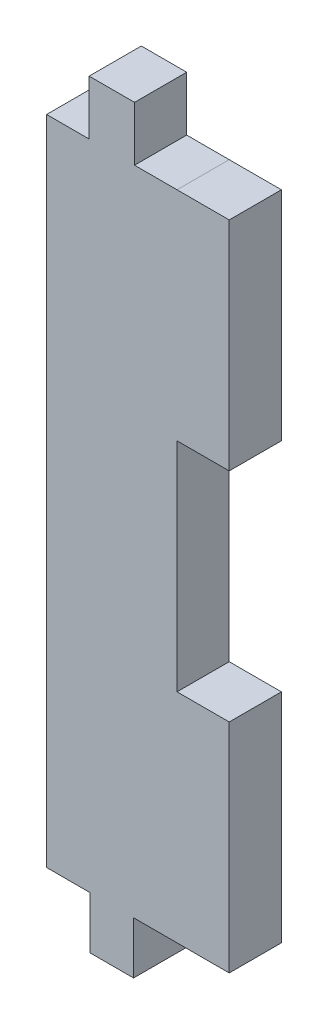
ISO-10303-21;
HEADER;
FILE_DESCRIPTION(('STEP AP214'),'2;1');
FILE_NAME('part.step','',(''),(''),'','','');
FILE_SCHEMA(('AUTOMOTIVE_DESIGN { 1 0 10303 214 1 1 1 1 }'));
ENDSEC;
DATA;
#1=APPLICATION_CONTEXT('core data for automotive mechanical design processes');
#2=APPLICATION_PROTOCOL_DEFINITION('international standard','automotive_design',2000,#1);
#3=PRODUCT_CONTEXT('',#1,'mechanical');
#4=PRODUCT('Part','Part','',(#3));
#5=PRODUCT_RELATED_PRODUCT_CATEGORY('part','',(#4));
#6=PRODUCT_DEFINITION_FORMATION('','',#4);
#7=PRODUCT_DEFINITION_CONTEXT('part definition',#1,'design');
#8=PRODUCT_DEFINITION('design','',#6,#7);
#9=PRODUCT_DEFINITION_SHAPE('','',#8);
#10=(LENGTH_UNIT() NAMED_UNIT(*) SI_UNIT(.MILLI.,.METRE.));
#11=(NAMED_UNIT(*) PLANE_ANGLE_UNIT() SI_UNIT($,.RADIAN.));
#12=(NAMED_UNIT(*) SI_UNIT($,.STERADIAN.) SOLID_ANGLE_UNIT());
#13=UNCERTAINTY_MEASURE_WITH_UNIT(LENGTH_MEASURE(1.E-05),#10,'distance_accuracy_value','');
#14=(GEOMETRIC_REPRESENTATION_CONTEXT(3) GLOBAL_UNCERTAINTY_ASSIGNED_CONTEXT((#13)) GLOBAL_UNIT_ASSIGNED_CONTEXT((#10,
#11,#12)) REPRESENTATION_CONTEXT('',''));
#15=CARTESIAN_POINT('',(0.,0.,0.));
#16=DIRECTION('',(0.,0.,1.));
#17=DIRECTION('',(1.,0.,0.));
#18=AXIS2_PLACEMENT_3D('',#15,#16,#17);
#19=CARTESIAN_POINT('',(-23.2300312184797,-66.1800034107966,4.));
#20=DIRECTION('',(-1.,0.,0.));
#21=DIRECTION('',(0.,0.,1.));
#22=AXIS2_PLACEMENT_3D('',#19,#20,#21);
#23=PLANE('',#22);
#24=DIRECTION('',(0.,0.,1.));
#25=VECTOR('',#24,1.);
#26=CARTESIAN_POINT('',(-23.2300312184797,-49.5136692647141,0.));
#27=LINE('',#26,#25);
#28=CARTESIAN_POINT('',(-23.2300312184797,-49.5136692647141,0.));
#29=VERTEX_POINT('',#28);
#30=CARTESIAN_POINT('',(-23.2300312184797,-49.5136692647141,4.));
#31=VERTEX_POINT('',#30);
#32=EDGE_CURVE('E423',#29,#31,#27,.T.);
#33=ORIENTED_EDGE('',*,*,#32,.T.);
#34=DIRECTION('',(0.,1.,0.));
#35=VECTOR('',#34,1.);
#36=CARTESIAN_POINT('',(-23.2300312184797,-66.1800034107966,4.));
#37=LINE('',#36,#35);
#38=CARTESIAN_POINT('',(-23.2300312184797,-66.1800034107966,4.));
#39=VERTEX_POINT('',#38);
#40=EDGE_CURVE('E329',#39,#31,#37,.T.);
#41=ORIENTED_EDGE('',*,*,#40,.F.);
#42=DIRECTION('',(0.,0.,-1.));
#43=VECTOR('',#42,1.);
#44=CARTESIAN_POINT('',(-23.2300312184797,-66.1800034107966,4.));
#45=LINE('',#44,#43);
#46=CARTESIAN_POINT('',(-23.2300312184797,-66.1800034107966,0.));
#47=VERTEX_POINT('',#46);
#48=EDGE_CURVE('E240',#39,#47,#45,.T.);
#49=ORIENTED_EDGE('',*,*,#48,.T.);
#50=DIRECTION('',(0.,1.,0.));
#51=VECTOR('',#50,1.);
#52=CARTESIAN_POINT('',(-23.2300312184797,-66.1800034107966,0.));
#53=LINE('',#52,#51);
#54=EDGE_CURVE('E336',#47,#29,#53,.T.);
#55=ORIENTED_EDGE('',*,*,#54,.T.);
#56=EDGE_LOOP('',(#33,#41,#49,#55));
#57=FACE_BOUND('',#56,.T.);
#58=ADVANCED_FACE('F105',(#57),#23,.F.);
#59=CARTESIAN_POINT('',(-37.2300312184796,-66.1800034107966,0.));
#60=DIRECTION('',(0.,0.,1.));
#61=DIRECTION('',(1.,0.,0.));
#62=AXIS2_PLACEMENT_3D('',#59,#60,#61);
#63=PLANE('',#62);
#64=DIRECTION('',(1.,0.,0.));
#65=VECTOR('',#64,1.);
#66=CARTESIAN_POINT('',(-37.2300312184797,-16.1800034107966,0.));
#67=LINE('',#66,#65);
#68=CARTESIAN_POINT('',(-30.4901950371512,-16.1800034107966,0.));
#69=VERTEX_POINT('',#68);
#70=CARTESIAN_POINT('',(-27.2300312184797,-16.1801696710887,0.));
#71=VERTEX_POINT('',#70);
#72=EDGE_CURVE('E257',#69,#71,#67,.T.);
#73=ORIENTED_EDGE('',*,*,#72,.T.);
#74=DIRECTION('',(1.,0.,0.));
#75=VECTOR('',#74,1.);
#76=CARTESIAN_POINT('',(-27.2300312184797,-16.1803359313808,0.));
#77=LINE('',#76,#75);
#78=CARTESIAN_POINT('',(-23.2300312184797,-16.1803359313808,0.));
#79=VERTEX_POINT('',#78);
#80=EDGE_CURVE('E332',#71,#79,#77,.T.);
#81=ORIENTED_EDGE('',*,*,#80,.T.);
#82=CARTESIAN_POINT('',(-23.2300312184797,-32.8470025980475,0.));
#83=VERTEX_POINT('',#82);
#84=EDGE_CURVE('E109',#83,#79,#53,.T.);
#85=ORIENTED_EDGE('',*,*,#84,.F.);
#86=DIRECTION('',(1.,0.,0.));
#87=VECTOR('',#86,1.);
#88=CARTESIAN_POINT('',(-27.2300312184797,-32.8470025980475,0.));
#89=LINE('',#88,#87);
#90=CARTESIAN_POINT('',(-27.2300312184797,-32.8470025980475,0.));
#91=VERTEX_POINT('',#90);
#92=EDGE_CURVE('E417',#91,#83,#89,.T.);
#93=ORIENTED_EDGE('',*,*,#92,.F.);
#94=DIRECTION('',(0.,-1.,0.));
#95=VECTOR('',#94,1.);
#96=CARTESIAN_POINT('',(-27.2300312184797,-66.1800034107966,0.));
#97=LINE('',#96,#95);
#98=CARTESIAN_POINT('',(-27.2300312184797,-49.5136692647141,0.));
#99=VERTEX_POINT('',#98);
#100=EDGE_CURVE('E411',#91,#99,#97,.T.);
#101=ORIENTED_EDGE('',*,*,#100,.T.);
#102=DIRECTION('',(1.,0.,0.));
#103=VECTOR('',#102,1.);
#104=CARTESIAN_POINT('',(-27.2300312184797,-49.5136692647141,0.));
#105=LINE('',#104,#103);
#106=EDGE_CURVE('E413',#99,#29,#105,.T.);
#107=ORIENTED_EDGE('',*,*,#106,.T.);
#108=ORIENTED_EDGE('',*,*,#54,.F.);
#109=DIRECTION('',(1.,0.,0.));
#110=VECTOR('',#109,1.);
#111=CARTESIAN_POINT('',(-37.2300312184796,-66.1800034107966,0.));
#112=LINE('',#111,#110);
#113=CARTESIAN_POINT('',(-30.563364551813,-66.1800034107966,0.));
#114=VERTEX_POINT('',#113);
#115=EDGE_CURVE('E254',#114,#47,#112,.T.);
#116=ORIENTED_EDGE('',*,*,#115,.F.);
#117=DIRECTION('',(0.,-1.,0.));
#118=VECTOR('',#117,1.);
#119=CARTESIAN_POINT('',(-30.563364551813,-62.1800034107967,0.));
#120=LINE('',#119,#118);
#121=CARTESIAN_POINT('',(-30.563364551813,-70.1800034107967,0.));
#122=VERTEX_POINT('',#121);
#123=EDGE_CURVE('E220',#114,#122,#120,.T.);
#124=ORIENTED_EDGE('',*,*,#123,.T.);
#125=DIRECTION('',(1.,0.,0.));
#126=VECTOR('',#125,1.);
#127=CARTESIAN_POINT('',(-33.8966978851463,-70.1800034107967,0.));
#128=LINE('',#127,#126);
#129=CARTESIAN_POINT('',(-33.8966978851463,-70.1800034107967,0.));
#130=VERTEX_POINT('',#129);
#131=EDGE_CURVE('E348',#130,#122,#128,.T.);
#132=ORIENTED_EDGE('',*,*,#131,.F.);
#133=DIRECTION('',(0.,-1.,0.));
#134=VECTOR('',#133,1.);
#135=CARTESIAN_POINT('',(-33.8966978851463,-62.1800034107967,0.));
#136=LINE('',#135,#134);
#137=CARTESIAN_POINT('',(-33.8966978851463,-66.1800034107966,0.));
#138=VERTEX_POINT('',#137);
#139=EDGE_CURVE('E235',#138,#130,#136,.T.);
#140=ORIENTED_EDGE('',*,*,#139,.F.);
#141=CARTESIAN_POINT('',(-37.2300312184796,-66.1800034107966,0.));
#142=VERTEX_POINT('',#141);
#143=EDGE_CURVE('E195',#142,#138,#112,.T.);
#144=ORIENTED_EDGE('',*,*,#143,.F.);
#145=DIRECTION('',(0.,-1.,0.));
#146=VECTOR('',#145,1.);
#147=CARTESIAN_POINT('',(-37.2300312184797,-16.1800034107966,0.));
#148=LINE('',#147,#146);
#149=CARTESIAN_POINT('',(-37.2300312184797,-16.1800034107966,0.));
#150=VERTEX_POINT('',#149);
#151=EDGE_CURVE('E251',#150,#142,#148,.T.);
#152=ORIENTED_EDGE('',*,*,#151,.F.);
#153=CARTESIAN_POINT('',(-33.9698673998081,-16.1800034107966,0.));
#154=VERTEX_POINT('',#153);
#155=EDGE_CURVE('E247',#150,#154,#67,.T.);
#156=ORIENTED_EDGE('',*,*,#155,.T.);
#157=DIRECTION('',(0.,-1.,0.));
#158=VECTOR('',#157,1.);
#159=CARTESIAN_POINT('',(-33.9698673998081,-12.0043965756084,0.));
#160=LINE('',#159,#158);
#161=CARTESIAN_POINT('',(-33.9698673998081,-12.0043965756084,0.));
#162=VERTEX_POINT('',#161);
#163=EDGE_CURVE('E369',#162,#154,#160,.T.);
#164=ORIENTED_EDGE('',*,*,#163,.F.);
#165=DIRECTION('',(1.,0.,0.));
#166=VECTOR('',#165,1.);
#167=CARTESIAN_POINT('',(-33.9698673998081,-12.0043965756084,0.));
#168=LINE('',#167,#166);
#169=CARTESIAN_POINT('',(-30.4901950371512,-12.0043965756084,0.));
#170=VERTEX_POINT('',#169);
#171=EDGE_CURVE('E360',#162,#170,#168,.T.);
#172=ORIENTED_EDGE('',*,*,#171,.T.);
#173=DIRECTION('',(0.,-1.,0.));
#174=VECTOR('',#173,1.);
#175=CARTESIAN_POINT('',(-30.4901950371512,-12.0043965756084,0.));
#176=LINE('',#175,#174);
#177=EDGE_CURVE('E373',#170,#69,#176,.T.);
#178=ORIENTED_EDGE('',*,*,#177,.T.);
#179=EDGE_LOOP('',(#73,#81,#85,#93,#101,#107,#108,#116,#124,#132,#140,#144,#152,#156,#164,#172,#178));
#180=FACE_BOUND('',#179,.T.);
#181=ADVANCED_FACE('F281',(#180),#63,.F.);
#182=CARTESIAN_POINT('',(-37.2300312184796,-66.1800034107966,4.));
#183=DIRECTION('',(0.,0.,1.));
#184=DIRECTION('',(1.,0.,0.));
#185=AXIS2_PLACEMENT_3D('',#182,#183,#184);
#186=PLANE('',#185);
#187=DIRECTION('',(1.,0.,0.));
#188=VECTOR('',#187,1.);
#189=CARTESIAN_POINT('',(-27.2300312184797,-32.8470025980475,4.00000000000001));
#190=LINE('',#189,#188);
#191=CARTESIAN_POINT('',(-27.2300312184797,-32.8470025980475,4.00000000000001));
#192=VERTEX_POINT('',#191);
#193=CARTESIAN_POINT('',(-23.2300312184797,-32.8470025980475,4.00000000000001));
#194=VERTEX_POINT('',#193);
#195=EDGE_CURVE('E438',#192,#194,#190,.T.);
#196=ORIENTED_EDGE('',*,*,#195,.T.);
#197=CARTESIAN_POINT('',(-23.2300312184797,-16.1803359313808,4.));
#198=VERTEX_POINT('',#197);
#199=EDGE_CURVE('E335',#194,#198,#37,.T.);
#200=ORIENTED_EDGE('',*,*,#199,.T.);
#201=DIRECTION('',(1.,0.,0.));
#202=VECTOR('',#201,1.);
#203=CARTESIAN_POINT('',(-27.2300312184797,-16.1803359313808,4.));
#204=LINE('',#203,#202);
#205=CARTESIAN_POINT('',(-27.2300312184797,-16.1801696710887,4.));
#206=VERTEX_POINT('',#205);
#207=EDGE_CURVE('E320',#206,#198,#204,.T.);
#208=ORIENTED_EDGE('',*,*,#207,.F.);
#209=DIRECTION('',(1.,0.,0.));
#210=VECTOR('',#209,1.);
#211=CARTESIAN_POINT('',(-37.2300312184797,-16.1800034107966,4.));
#212=LINE('',#211,#210);
#213=CARTESIAN_POINT('',(-30.4901950371512,-16.1800034107966,4.));
#214=VERTEX_POINT('',#213);
#215=EDGE_CURVE('E245',#214,#206,#212,.T.);
#216=ORIENTED_EDGE('',*,*,#215,.F.);
#217=DIRECTION('',(0.,-1.,0.));
#218=VECTOR('',#217,1.);
#219=CARTESIAN_POINT('',(-30.4901950371512,-12.0043965756084,4.));
#220=LINE('',#219,#218);
#221=CARTESIAN_POINT('',(-30.4901950371512,-12.0043965756084,4.));
#222=VERTEX_POINT('',#221);
#223=EDGE_CURVE('E380',#222,#214,#220,.T.);
#224=ORIENTED_EDGE('',*,*,#223,.F.);
#225=DIRECTION('',(1.,0.,0.));
#226=VECTOR('',#225,1.);
#227=CARTESIAN_POINT('',(-33.9698673998081,-12.0043965756084,4.));
#228=LINE('',#227,#226);
#229=CARTESIAN_POINT('',(-33.9698673998081,-12.0043965756084,4.));
#230=VERTEX_POINT('',#229);
#231=EDGE_CURVE('E372',#230,#222,#228,.T.);
#232=ORIENTED_EDGE('',*,*,#231,.F.);
#233=DIRECTION('',(0.,-1.,0.));
#234=VECTOR('',#233,1.);
#235=CARTESIAN_POINT('',(-33.9698673998081,-12.0043965756084,4.));
#236=LINE('',#235,#234);
#237=CARTESIAN_POINT('',(-33.9698673998081,-16.1800034107966,4.));
#238=VERTEX_POINT('',#237);
#239=EDGE_CURVE('E367',#230,#238,#236,.T.);
#240=ORIENTED_EDGE('',*,*,#239,.T.);
#241=CARTESIAN_POINT('',(-37.2300312184797,-16.1800034107966,4.));
#242=VERTEX_POINT('',#241);
#243=EDGE_CURVE('E260',#242,#238,#212,.T.);
#244=ORIENTED_EDGE('',*,*,#243,.F.);
#245=DIRECTION('',(0.,-1.,0.));
#246=VECTOR('',#245,1.);
#247=CARTESIAN_POINT('',(-37.2300312184797,-16.1800034107966,4.));
#248=LINE('',#247,#246);
#249=CARTESIAN_POINT('',(-37.2300312184796,-66.1800034107966,4.));
#250=VERTEX_POINT('',#249);
#251=EDGE_CURVE('E242',#242,#250,#248,.T.);
#252=ORIENTED_EDGE('',*,*,#251,.T.);
#253=DIRECTION('',(1.,0.,0.));
#254=VECTOR('',#253,1.);
#255=CARTESIAN_POINT('',(-37.2300312184796,-66.1800034107966,4.));
#256=LINE('',#255,#254);
#257=CARTESIAN_POINT('',(-33.8966978851463,-66.1800034107966,4.));
#258=VERTEX_POINT('',#257);
#259=EDGE_CURVE('E241',#250,#258,#256,.T.);
#260=ORIENTED_EDGE('',*,*,#259,.T.);
#261=DIRECTION('',(0.,-1.,0.));
#262=VECTOR('',#261,1.);
#263=CARTESIAN_POINT('',(-33.8966978851463,-62.1800034107967,4.));
#264=LINE('',#263,#262);
#265=CARTESIAN_POINT('',(-33.8966978851463,-70.1800034107967,4.));
#266=VERTEX_POINT('',#265);
#267=EDGE_CURVE('E354',#258,#266,#264,.T.);
#268=ORIENTED_EDGE('',*,*,#267,.T.);
#269=DIRECTION('',(1.,0.,0.));
#270=VECTOR('',#269,1.);
#271=CARTESIAN_POINT('',(-33.8966978851463,-70.1800034107967,4.));
#272=LINE('',#271,#270);
#273=CARTESIAN_POINT('',(-30.563364551813,-70.1800034107967,4.));
#274=VERTEX_POINT('',#273);
#275=EDGE_CURVE('E233',#266,#274,#272,.T.);
#276=ORIENTED_EDGE('',*,*,#275,.T.);
#277=DIRECTION('',(0.,-1.,0.));
#278=VECTOR('',#277,1.);
#279=CARTESIAN_POINT('',(-30.563364551813,-62.1800034107967,4.));
#280=LINE('',#279,#278);
#281=CARTESIAN_POINT('',(-30.563364551813,-66.1800034107966,4.));
#282=VERTEX_POINT('',#281);
#283=EDGE_CURVE('E218',#282,#274,#280,.T.);
#284=ORIENTED_EDGE('',*,*,#283,.F.);
#285=EDGE_CURVE('E230',#282,#39,#256,.T.);
#286=ORIENTED_EDGE('',*,*,#285,.T.);
#287=ORIENTED_EDGE('',*,*,#40,.T.);
#288=DIRECTION('',(1.,0.,0.));
#289=VECTOR('',#288,1.);
#290=CARTESIAN_POINT('',(-27.2300312184797,-49.5136692647141,4.00000000000001));
#291=LINE('',#290,#289);
#292=CARTESIAN_POINT('',(-27.2300312184797,-49.5136692647141,4.00000000000001));
#293=VERTEX_POINT('',#292);
#294=EDGE_CURVE('E123',#293,#31,#291,.T.);
#295=ORIENTED_EDGE('',*,*,#294,.F.);
#296=DIRECTION('',(0.,1.,0.));
#297=VECTOR('',#296,1.);
#298=CARTESIAN_POINT('',(-27.2300312184797,-49.5136692647141,4.00000000000001));
#299=LINE('',#298,#297);
#300=EDGE_CURVE('E429',#293,#192,#299,.T.);
#301=ORIENTED_EDGE('',*,*,#300,.T.);
#302=EDGE_LOOP('',(#196,#200,#208,#216,#224,#232,#240,#244,#252,#260,#268,#276,#284,#286,#287,
#295,#301));
#303=FACE_BOUND('',#302,.T.);
#304=ADVANCED_FACE('F228',(#303),#186,.T.);
#305=CARTESIAN_POINT('',(-37.2300312184797,-16.1800034107966,4.));
#306=DIRECTION('',(0.,1.,0.));
#307=DIRECTION('',(0.,0.,1.));
#308=AXIS2_PLACEMENT_3D('',#305,#306,#307);
#309=PLANE('',#308);
#310=ORIENTED_EDGE('',*,*,#243,.T.);
#311=DIRECTION('',(0.,0.,-1.));
#312=VECTOR('',#311,1.);
#313=CARTESIAN_POINT('',(-33.9698673998081,-16.1800034107966,4.));
#314=LINE('',#313,#312);
#315=EDGE_CURVE('E224',#238,#154,#314,.T.);
#316=ORIENTED_EDGE('',*,*,#315,.T.);
#317=ORIENTED_EDGE('',*,*,#155,.F.);
#318=DIRECTION('',(0.,0.,-1.));
#319=VECTOR('',#318,1.);
#320=CARTESIAN_POINT('',(-37.2300312184797,-16.1800034107966,4.));
#321=LINE('',#320,#319);
#322=EDGE_CURVE('E258',#242,#150,#321,.T.);
#323=ORIENTED_EDGE('',*,*,#322,.F.);
#324=EDGE_LOOP('',(#310,#316,#317,#323));
#325=FACE_BOUND('',#324,.T.);
#326=ADVANCED_FACE('F279',(#325),#309,.T.);
#327=CARTESIAN_POINT('',(-37.2300312184797,-16.1800034107966,4.));
#328=DIRECTION('',(1.,0.,0.));
#329=DIRECTION('',(0.,1.,0.));
#330=AXIS2_PLACEMENT_3D('',#327,#328,#329);
#331=PLANE('',#330);
#332=ORIENTED_EDGE('',*,*,#151,.T.);
#333=DIRECTION('',(0.,0.,-1.));
#334=VECTOR('',#333,1.);
#335=CARTESIAN_POINT('',(-37.2300312184796,-66.1800034107966,4.));
#336=LINE('',#335,#334);
#337=EDGE_CURVE('E261',#250,#142,#336,.T.);
#338=ORIENTED_EDGE('',*,*,#337,.F.);
#339=ORIENTED_EDGE('',*,*,#251,.F.);
#340=ORIENTED_EDGE('',*,*,#322,.T.);
#341=EDGE_LOOP('',(#332,#338,#339,#340));
#342=FACE_BOUND('',#341,.T.);
#343=ADVANCED_FACE('F286',(#342),#331,.F.);
#344=CARTESIAN_POINT('',(-37.2300312184796,-66.1800034107966,4.));
#345=DIRECTION('',(0.,1.,0.));
#346=DIRECTION('',(0.,0.,1.));
#347=AXIS2_PLACEMENT_3D('',#344,#345,#346);
#348=PLANE('',#347);
#349=DIRECTION('',(0.,0.,-1.));
#350=VECTOR('',#349,1.);
#351=CARTESIAN_POINT('',(-33.8966978851463,-66.1800034107966,4.));
#352=LINE('',#351,#350);
#353=EDGE_CURVE('E12',#258,#138,#352,.T.);
#354=ORIENTED_EDGE('',*,*,#353,.F.);
#355=ORIENTED_EDGE('',*,*,#259,.F.);
#356=ORIENTED_EDGE('',*,*,#337,.T.);
#357=ORIENTED_EDGE('',*,*,#143,.T.);
#358=EDGE_LOOP('',(#354,#355,#356,#357));
#359=FACE_BOUND('',#358,.T.);
#360=ADVANCED_FACE('F285',(#359),#348,.F.);
#361=ORIENTED_EDGE('',*,*,#285,.F.);
#362=DIRECTION('',(0.,0.,-1.));
#363=VECTOR('',#362,1.);
#364=CARTESIAN_POINT('',(-30.563364551813,-66.1800034107966,4.));
#365=LINE('',#364,#363);
#366=EDGE_CURVE('E115',#282,#114,#365,.T.);
#367=ORIENTED_EDGE('',*,*,#366,.T.);
#368=ORIENTED_EDGE('',*,*,#115,.T.);
#369=ORIENTED_EDGE('',*,*,#48,.F.);
#370=EDGE_LOOP('',(#361,#367,#368,#369));
#371=FACE_BOUND('',#370,.T.);
#372=ADVANCED_FACE('F238',(#371),#348,.F.);
#373=DIRECTION('',(0.,0.,-1.));
#374=VECTOR('',#373,1.);
#375=CARTESIAN_POINT('',(-30.4901950371512,-16.1800034107966,4.));
#376=LINE('',#375,#374);
#377=EDGE_CURVE('E132',#214,#69,#376,.T.);
#378=ORIENTED_EDGE('',*,*,#377,.F.);
#379=ORIENTED_EDGE('',*,*,#215,.T.);
#380=CARTESIAN_POINT('',(-27.2300312184797,-16.1800034107966,4.));
#381=DIRECTION('',(0.,0.,-1.));
#382=VECTOR('',#381,1.);
#383=LINE('',#380,#382);
#384=EDGE_CURVE('E184',#206,#71,#383,.T.);
#385=ORIENTED_EDGE('',*,*,#384,.T.);
#386=ORIENTED_EDGE('',*,*,#72,.F.);
#387=EDGE_LOOP('',(#378,#379,#385,#386));
#388=FACE_BOUND('',#387,.T.);
#389=ADVANCED_FACE('F268',(#388),#309,.T.);
#390=CARTESIAN_POINT('',(-33.8966978851463,-70.1800034107967,4.));
#391=DIRECTION('',(0.,1.,0.));
#392=DIRECTION('',(0.,0.,1.));
#393=AXIS2_PLACEMENT_3D('',#390,#391,#392);
#394=PLANE('',#393);
#395=ORIENTED_EDGE('',*,*,#131,.T.);
#396=DIRECTION('',(0.,0.,-1.));
#397=VECTOR('',#396,1.);
#398=CARTESIAN_POINT('',(-30.563364551813,-70.1800034107967,4.));
#399=LINE('',#398,#397);
#400=EDGE_CURVE('E361',#274,#122,#399,.T.);
#401=ORIENTED_EDGE('',*,*,#400,.F.);
#402=ORIENTED_EDGE('',*,*,#275,.F.);
#403=DIRECTION('',(0.,0.,-1.));
#404=VECTOR('',#403,1.);
#405=CARTESIAN_POINT('',(-33.8966978851463,-70.1800034107967,4.));
#406=LINE('',#405,#404);
#407=EDGE_CURVE('E358',#266,#130,#406,.T.);
#408=ORIENTED_EDGE('',*,*,#407,.T.);
#409=EDGE_LOOP('',(#395,#401,#402,#408));
#410=FACE_BOUND('',#409,.T.);
#411=ADVANCED_FACE('F278',(#410),#394,.F.);
#412=CARTESIAN_POINT('',(-30.563364551813,-62.1800034107967,4.));
#413=DIRECTION('',(1.,0.,0.));
#414=DIRECTION('',(0.,0.,-1.));
#415=AXIS2_PLACEMENT_3D('',#412,#413,#414);
#416=PLANE('',#415);
#417=ORIENTED_EDGE('',*,*,#366,.F.);
#418=ORIENTED_EDGE('',*,*,#283,.T.);
#419=ORIENTED_EDGE('',*,*,#400,.T.);
#420=ORIENTED_EDGE('',*,*,#123,.F.);
#421=EDGE_LOOP('',(#417,#418,#419,#420));
#422=FACE_BOUND('',#421,.T.);
#423=ADVANCED_FACE('F216',(#422),#416,.T.);
#424=CARTESIAN_POINT('',(-33.8966978851463,-62.1800034107967,4.));
#425=DIRECTION('',(1.,0.,0.));
#426=DIRECTION('',(0.,0.,-1.));
#427=AXIS2_PLACEMENT_3D('',#424,#425,#426);
#428=PLANE('',#427);
#429=ORIENTED_EDGE('',*,*,#267,.F.);
#430=ORIENTED_EDGE('',*,*,#353,.T.);
#431=ORIENTED_EDGE('',*,*,#139,.T.);
#432=ORIENTED_EDGE('',*,*,#407,.F.);
#433=EDGE_LOOP('',(#429,#430,#431,#432));
#434=FACE_BOUND('',#433,.T.);
#435=ADVANCED_FACE('F280',(#434),#428,.F.);
#436=CARTESIAN_POINT('',(-27.2300312184797,-16.1803359313808,4.));
#437=DIRECTION('',(0.,1.,0.));
#438=DIRECTION('',(0.,0.,1.));
#439=AXIS2_PLACEMENT_3D('',#436,#437,#438);
#440=PLANE('',#439);
#441=ORIENTED_EDGE('',*,*,#80,.F.);
#442=ORIENTED_EDGE('',*,*,#384,.F.);
#443=ORIENTED_EDGE('',*,*,#207,.T.);
#444=DIRECTION('',(0.,0.,-1.));
#445=VECTOR('',#444,1.);
#446=CARTESIAN_POINT('',(-23.2300312184797,-16.1803359313808,4.));
#447=LINE('',#446,#445);
#448=EDGE_CURVE('E328',#198,#79,#447,.T.);
#449=ORIENTED_EDGE('',*,*,#448,.T.);
#450=EDGE_LOOP('',(#441,#442,#443,#449));
#451=FACE_BOUND('',#450,.T.);
#452=ADVANCED_FACE('F305',(#451),#440,.T.);
#453=ORIENTED_EDGE('',*,*,#199,.F.);
#454=DIRECTION('',(0.,0.,1.));
#455=VECTOR('',#454,1.);
#456=CARTESIAN_POINT('',(-23.2300312184797,-32.8470025980475,0.));
#457=LINE('',#456,#455);
#458=EDGE_CURVE('E409',#83,#194,#457,.T.);
#459=ORIENTED_EDGE('',*,*,#458,.F.);
#460=ORIENTED_EDGE('',*,*,#84,.T.);
#461=ORIENTED_EDGE('',*,*,#448,.F.);
#462=EDGE_LOOP('',(#453,#459,#460,#461));
#463=FACE_BOUND('',#462,.T.);
#464=ADVANCED_FACE('F107',(#463),#23,.F.);
#465=CARTESIAN_POINT('',(-30.4901950371512,-12.0043965756084,4.));
#466=DIRECTION('',(1.,0.,0.));
#467=DIRECTION('',(0.,0.,-1.));
#468=AXIS2_PLACEMENT_3D('',#465,#466,#467);
#469=PLANE('',#468);
#470=ORIENTED_EDGE('',*,*,#223,.T.);
#471=ORIENTED_EDGE('',*,*,#377,.T.);
#472=ORIENTED_EDGE('',*,*,#177,.F.);
#473=DIRECTION('',(0.,0.,-1.));
#474=VECTOR('',#473,1.);
#475=CARTESIAN_POINT('',(-30.4901950371512,-12.0043965756084,4.));
#476=LINE('',#475,#474);
#477=EDGE_CURVE('E365',#222,#170,#476,.T.);
#478=ORIENTED_EDGE('',*,*,#477,.F.);
#479=EDGE_LOOP('',(#470,#471,#472,#478));
#480=FACE_BOUND('',#479,.T.);
#481=ADVANCED_FACE('F296',(#480),#469,.T.);
#482=CARTESIAN_POINT('',(-33.9698673998081,-12.0043965756084,4.));
#483=DIRECTION('',(0.,1.,0.));
#484=DIRECTION('',(0.,0.,1.));
#485=AXIS2_PLACEMENT_3D('',#482,#483,#484);
#486=PLANE('',#485);
#487=ORIENTED_EDGE('',*,*,#171,.F.);
#488=DIRECTION('',(0.,0.,-1.));
#489=VECTOR('',#488,1.);
#490=CARTESIAN_POINT('',(-33.9698673998081,-12.0043965756084,4.));
#491=LINE('',#490,#489);
#492=EDGE_CURVE('E255',#230,#162,#491,.T.);
#493=ORIENTED_EDGE('',*,*,#492,.F.);
#494=ORIENTED_EDGE('',*,*,#231,.T.);
#495=ORIENTED_EDGE('',*,*,#477,.T.);
#496=EDGE_LOOP('',(#487,#493,#494,#495));
#497=FACE_BOUND('',#496,.T.);
#498=ADVANCED_FACE('F294',(#497),#486,.T.);
#499=CARTESIAN_POINT('',(-33.9698673998081,-12.0043965756084,4.));
#500=DIRECTION('',(1.,0.,0.));
#501=DIRECTION('',(0.,0.,-1.));
#502=AXIS2_PLACEMENT_3D('',#499,#500,#501);
#503=PLANE('',#502);
#504=ORIENTED_EDGE('',*,*,#315,.F.);
#505=ORIENTED_EDGE('',*,*,#239,.F.);
#506=ORIENTED_EDGE('',*,*,#492,.T.);
#507=ORIENTED_EDGE('',*,*,#163,.T.);
#508=EDGE_LOOP('',(#504,#505,#506,#507));
#509=FACE_BOUND('',#508,.T.);
#510=ADVANCED_FACE('F290',(#509),#503,.F.);
#511=CARTESIAN_POINT('',(-27.2300312184797,-66.1803359313808,-9.99999999999997));
#512=DIRECTION('',(-1.,0.,0.));
#513=DIRECTION('',(0.,0.,1.));
#514=AXIS2_PLACEMENT_3D('',#511,#512,#513);
#515=PLANE('',#514);
#516=DIRECTION('',(0.,0.,1.));
#517=VECTOR('',#516,1.);
#518=CARTESIAN_POINT('',(-27.2300312184797,-32.8470025980475,0.));
#519=LINE('',#518,#517);
#520=EDGE_CURVE('E435',#91,#192,#519,.T.);
#521=ORIENTED_EDGE('',*,*,#520,.T.);
#522=ORIENTED_EDGE('',*,*,#300,.F.);
#523=DIRECTION('',(0.,0.,1.));
#524=VECTOR('',#523,1.);
#525=CARTESIAN_POINT('',(-27.2300312184797,-49.5136692647141,0.));
#526=LINE('',#525,#524);
#527=EDGE_CURVE('E427',#99,#293,#526,.T.);
#528=ORIENTED_EDGE('',*,*,#527,.F.);
#529=ORIENTED_EDGE('',*,*,#100,.F.);
#530=EDGE_LOOP('',(#521,#522,#528,#529));
#531=FACE_BOUND('',#530,.T.);
#532=ADVANCED_FACE('F293',(#531),#515,.F.);
#533=CARTESIAN_POINT('',(-27.2300312184797,-32.8470025980475,0.));
#534=DIRECTION('',(0.,1.,0.));
#535=DIRECTION('',(-1.,0.,0.));
#536=AXIS2_PLACEMENT_3D('',#533,#534,#535);
#537=PLANE('',#536);
#538=ORIENTED_EDGE('',*,*,#458,.T.);
#539=ORIENTED_EDGE('',*,*,#195,.F.);
#540=ORIENTED_EDGE('',*,*,#520,.F.);
#541=ORIENTED_EDGE('',*,*,#92,.T.);
#542=EDGE_LOOP('',(#538,#539,#540,#541));
#543=FACE_BOUND('',#542,.T.);
#544=ADVANCED_FACE('F544',(#543),#537,.F.);
#545=CARTESIAN_POINT('',(-27.2300312184797,-49.5136692647141,0.));
#546=DIRECTION('',(0.,1.,0.));
#547=DIRECTION('',(-1.,0.,0.));
#548=AXIS2_PLACEMENT_3D('',#545,#546,#547);
#549=PLANE('',#548);
#550=ORIENTED_EDGE('',*,*,#32,.F.);
#551=ORIENTED_EDGE('',*,*,#106,.F.);
#552=ORIENTED_EDGE('',*,*,#527,.T.);
#553=ORIENTED_EDGE('',*,*,#294,.T.);
#554=EDGE_LOOP('',(#550,#551,#552,#553));
#555=FACE_BOUND('',#554,.T.);
#556=ADVANCED_FACE('F458',(#555),#549,.T.);
#557=CLOSED_SHELL('',(#58,#181,#304,#326,#343,#360,#372,#389,#411,#423,#435,#452,#464,#481,#498,
#510,#532,#544,#556));
#558=MANIFOLD_SOLID_BREP('B2',#557);
#559=ADVANCED_BREP_SHAPE_REPRESENTATION('',(#18,#558),#14);
#560=SHAPE_DEFINITION_REPRESENTATION(#9,#559);
ENDSEC;
END-ISO-10303-21;
